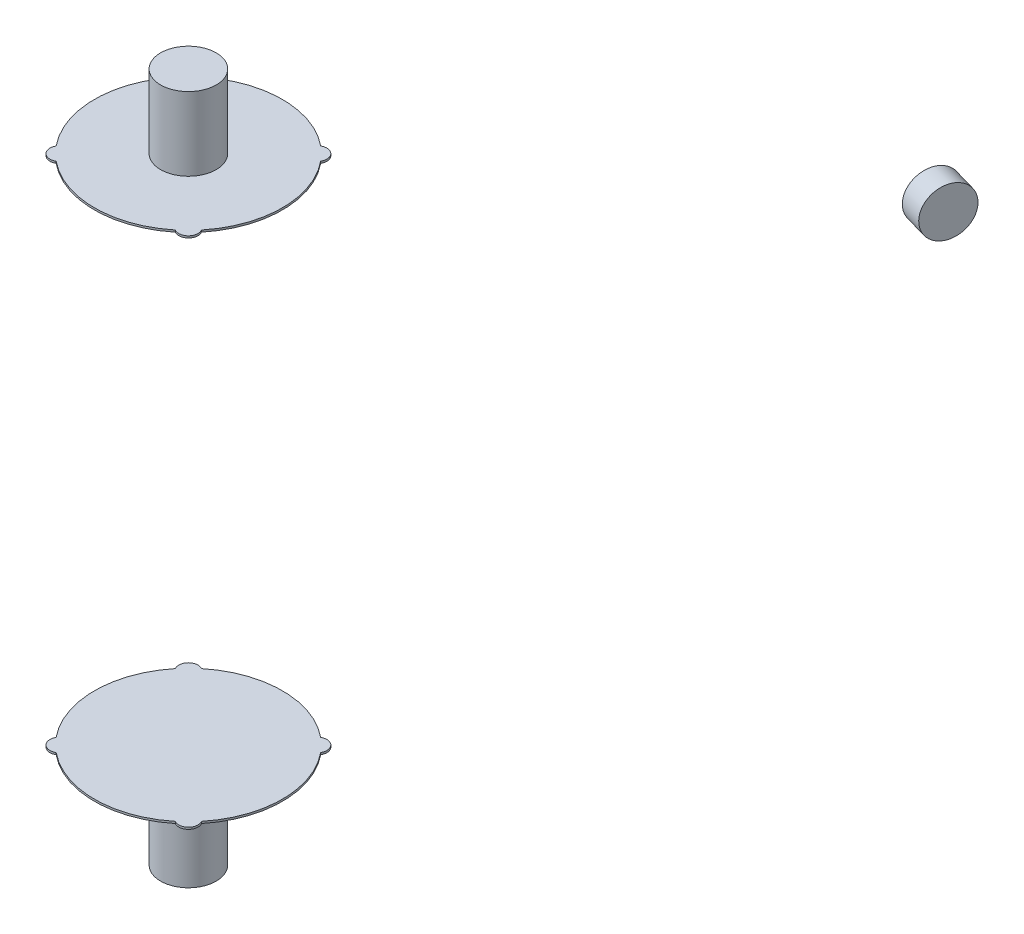
ISO-10303-21;
HEADER;
FILE_DESCRIPTION(('STEP AP214'),'2;1');
FILE_NAME('part.step','',(''),(''),'','','');
FILE_SCHEMA(('AUTOMOTIVE_DESIGN { 1 0 10303 214 1 1 1 1 }'));
ENDSEC;
DATA;
#1=APPLICATION_CONTEXT('core data for automotive mechanical design processes');
#2=APPLICATION_PROTOCOL_DEFINITION('international standard','automotive_design',2000,#1);
#3=PRODUCT_CONTEXT('',#1,'mechanical');
#4=PRODUCT('Part','Part','',(#3));
#5=PRODUCT_RELATED_PRODUCT_CATEGORY('part','',(#4));
#6=PRODUCT_DEFINITION_FORMATION('','',#4);
#7=PRODUCT_DEFINITION_CONTEXT('part definition',#1,'design');
#8=PRODUCT_DEFINITION('design','',#6,#7);
#9=PRODUCT_DEFINITION_SHAPE('','',#8);
#10=(LENGTH_UNIT() NAMED_UNIT(*) SI_UNIT(.MILLI.,.METRE.));
#11=(NAMED_UNIT(*) PLANE_ANGLE_UNIT() SI_UNIT($,.RADIAN.));
#12=(NAMED_UNIT(*) SI_UNIT($,.STERADIAN.) SOLID_ANGLE_UNIT());
#13=UNCERTAINTY_MEASURE_WITH_UNIT(LENGTH_MEASURE(1.E-05),#10,'distance_accuracy_value','');
#14=(GEOMETRIC_REPRESENTATION_CONTEXT(3) GLOBAL_UNCERTAINTY_ASSIGNED_CONTEXT((#13)) GLOBAL_UNIT_ASSIGNED_CONTEXT((#10,
#11,#12)) REPRESENTATION_CONTEXT('',''));
#15=CARTESIAN_POINT('',(0.,0.,0.));
#16=DIRECTION('',(0.,0.,1.));
#17=DIRECTION('',(1.,0.,0.));
#18=AXIS2_PLACEMENT_3D('',#15,#16,#17);
#19=CARTESIAN_POINT('',(0.,359.5,1120.));
#20=DIRECTION('',(0.,-1.,0.));
#21=DIRECTION('',(0.,0.,-1.));
#22=AXIS2_PLACEMENT_3D('',#19,#20,#21);
#23=PLANE('',#22);
#24=CARTESIAN_POINT('',(0.,359.5,1120.));
#25=DIRECTION('',(0.,-1.,0.));
#26=DIRECTION('',(-1.,0.,0.));
#27=AXIS2_PLACEMENT_3D('',#24,#25,#26);
#28=CIRCLE('',#27,29.);
#29=CARTESIAN_POINT('',(-29.,359.5,1120.));
#30=VERTEX_POINT('',#29);
#31=EDGE_CURVE('E243',#30,#30,#28,.T.);
#32=ORIENTED_EDGE('',*,*,#31,.F.);
#33=EDGE_LOOP('',(#32));
#34=FACE_BOUND('',#33,.T.);
#35=ADVANCED_FACE('F322',(#34),#23,.F.);
#36=CARTESIAN_POINT('',(0.,359.5,1120.));
#37=DIRECTION('',(0.,-1.,0.));
#38=DIRECTION('',(0.,0.,-1.));
#39=AXIS2_PLACEMENT_3D('',#36,#37,#38);
#40=CYLINDRICAL_SURFACE('',#39,29.);
#41=ORIENTED_EDGE('',*,*,#31,.T.);
#42=EDGE_LOOP('',(#41));
#43=FACE_BOUND('',#42,.T.);
#44=CARTESIAN_POINT('',(0.,283.,1120.));
#45=DIRECTION('',(0.,-1.,0.));
#46=DIRECTION('',(-1.,0.,0.));
#47=AXIS2_PLACEMENT_3D('',#44,#45,#46);
#48=CIRCLE('',#47,29.);
#49=CARTESIAN_POINT('',(-29.,283.,1120.));
#50=VERTEX_POINT('',#49);
#51=EDGE_CURVE('E238',#50,#50,#48,.T.);
#52=ORIENTED_EDGE('',*,*,#51,.F.);
#53=EDGE_LOOP('',(#52));
#54=FACE_BOUND('',#53,.T.);
#55=ADVANCED_FACE('F324',(#43,#54),#40,.T.);
#56=CARTESIAN_POINT('',(33.587572106361,283.,1086.41242789364));
#57=DIRECTION('',(0.,-1.,0.));
#58=DIRECTION('',(0.,0.,-1.));
#59=AXIS2_PLACEMENT_3D('',#56,#57,#58);
#60=PLANE('',#59);
#61=ORIENTED_EDGE('',*,*,#51,.T.);
#62=EDGE_LOOP('',(#61));
#63=FACE_BOUND('',#62,.T.);
#64=CARTESIAN_POINT('',(0.,283.,1120.));
#65=DIRECTION('',(0.,-1.,0.));
#66=DIRECTION('',(-1.,0.,0.));
#67=AXIS2_PLACEMENT_3D('',#64,#65,#66);
#68=CIRCLE('',#67,98.);
#69=CARTESIAN_POINT('',(-62.1151265949994,283.,1044.19953134652));
#70=VERTEX_POINT('',#69);
#71=CARTESIAN_POINT('',(62.1151265949994,283.,1044.19953134652));
#72=VERTEX_POINT('',#71);
#73=EDGE_CURVE('E157',#70,#72,#68,.T.);
#74=ORIENTED_EDGE('',*,*,#73,.F.);
#75=CARTESIAN_POINT('',(-67.175144212722,283.,1052.82485578728));
#76=DIRECTION('',(0.,-1.,0.));
#77=DIRECTION('',(1.,0.,0.));
#78=AXIS2_PLACEMENT_3D('',#75,#76,#77);
#79=CIRCLE('',#78,10.);
#80=CARTESIAN_POINT('',(-75.80046865348,283.,1057.884873405));
#81=VERTEX_POINT('',#80);
#82=EDGE_CURVE('E149',#81,#70,#79,.T.);
#83=ORIENTED_EDGE('',*,*,#82,.F.);
#84=CARTESIAN_POINT('',(0.,283.,1120.));
#85=DIRECTION('',(0.,-1.,0.));
#86=DIRECTION('',(1.,0.,0.));
#87=AXIS2_PLACEMENT_3D('',#84,#85,#86);
#88=CIRCLE('',#87,98.);
#89=CARTESIAN_POINT('',(-75.8004686534801,283.,1182.115126595));
#90=VERTEX_POINT('',#89);
#91=EDGE_CURVE('E154',#90,#81,#88,.T.);
#92=ORIENTED_EDGE('',*,*,#91,.F.);
#93=CARTESIAN_POINT('',(-67.175144212722,283.,1187.17514421272));
#94=DIRECTION('',(0.,-1.,0.));
#95=DIRECTION('',(1.,0.,0.));
#96=AXIS2_PLACEMENT_3D('',#93,#94,#95);
#97=CIRCLE('',#96,10.);
#98=CARTESIAN_POINT('',(-62.1151265949995,283.,1195.80046865348));
#99=VERTEX_POINT('',#98);
#100=EDGE_CURVE('E218',#99,#90,#97,.T.);
#101=ORIENTED_EDGE('',*,*,#100,.F.);
#102=CARTESIAN_POINT('',(0.,283.,1120.));
#103=DIRECTION('',(0.,-1.,0.));
#104=DIRECTION('',(-1.,0.,0.));
#105=AXIS2_PLACEMENT_3D('',#102,#103,#104);
#106=CIRCLE('',#105,98.);
#107=CARTESIAN_POINT('',(62.1151265949994,283.,1195.80046865348));
#108=VERTEX_POINT('',#107);
#109=EDGE_CURVE('E216',#108,#99,#106,.T.);
#110=ORIENTED_EDGE('',*,*,#109,.F.);
#111=CARTESIAN_POINT('',(67.175144212722,283.,1187.17514421272));
#112=DIRECTION('',(0.,-1.,0.));
#113=DIRECTION('',(-1.,0.,0.));
#114=AXIS2_PLACEMENT_3D('',#111,#112,#113);
#115=CIRCLE('',#114,10.);
#116=CARTESIAN_POINT('',(75.80046865348,283.,1182.115126595));
#117=VERTEX_POINT('',#116);
#118=EDGE_CURVE('E208',#117,#108,#115,.T.);
#119=ORIENTED_EDGE('',*,*,#118,.F.);
#120=CARTESIAN_POINT('',(0.,283.,1120.));
#121=DIRECTION('',(0.,-1.,0.));
#122=DIRECTION('',(-1.,0.,0.));
#123=AXIS2_PLACEMENT_3D('',#120,#121,#122);
#124=CIRCLE('',#123,98.);
#125=CARTESIAN_POINT('',(75.8004686534801,283.,1057.884873405));
#126=VERTEX_POINT('',#125);
#127=EDGE_CURVE('E203',#126,#117,#124,.T.);
#128=ORIENTED_EDGE('',*,*,#127,.F.);
#129=CARTESIAN_POINT('',(67.175144212722,283.,1052.82485578728));
#130=DIRECTION('',(0.,-1.,0.));
#131=DIRECTION('',(-1.,0.,0.));
#132=AXIS2_PLACEMENT_3D('',#129,#130,#131);
#133=CIRCLE('',#132,10.);
#134=EDGE_CURVE('E209',#72,#126,#133,.T.);
#135=ORIENTED_EDGE('',*,*,#134,.F.);
#136=EDGE_LOOP('',(#74,#83,#92,#101,#110,#119,#128,#135));
#137=FACE_BOUND('',#136,.T.);
#138=ADVANCED_FACE('F213',(#63,#137),#60,.F.);
#139=CARTESIAN_POINT('',(-67.175144212722,258.,1187.17514421272));
#140=DIRECTION('',(0.,1.,0.));
#141=DIRECTION('',(0.,0.,1.));
#142=AXIS2_PLACEMENT_3D('',#139,#140,#141);
#143=CYLINDRICAL_SURFACE('',#142,10.);
#144=DIRECTION('',(0.,1.,0.));
#145=VECTOR('',#144,1.);
#146=CARTESIAN_POINT('',(-75.80046865348,269.5,1182.115126595));
#147=LINE('',#146,#145);
#148=CARTESIAN_POINT('',(-75.80046865348,281.,1182.115126595));
#149=VERTEX_POINT('',#148);
#150=EDGE_CURVE('E186',#149,#90,#147,.T.);
#151=ORIENTED_EDGE('',*,*,#150,.F.);
#152=CARTESIAN_POINT('',(-67.175144212722,281.,1187.17514421272));
#153=DIRECTION('',(0.,1.,0.));
#154=DIRECTION('',(0.,0.,1.));
#155=AXIS2_PLACEMENT_3D('',#152,#153,#154);
#156=CIRCLE('',#155,10.);
#157=CARTESIAN_POINT('',(-62.1151265949995,281.,1195.80046865348));
#158=VERTEX_POINT('',#157);
#159=EDGE_CURVE('E284',#149,#158,#156,.T.);
#160=ORIENTED_EDGE('',*,*,#159,.T.);
#161=DIRECTION('',(0.,1.,0.));
#162=VECTOR('',#161,1.);
#163=CARTESIAN_POINT('',(-62.1151265949994,269.5,1195.80046865348));
#164=LINE('',#163,#162);
#165=EDGE_CURVE('E188',#99,#158,#164,.F.);
#166=ORIENTED_EDGE('',*,*,#165,.F.);
#167=ORIENTED_EDGE('',*,*,#100,.T.);
#168=EDGE_LOOP('',(#151,#160,#166,#167));
#169=FACE_BOUND('',#168,.T.);
#170=ADVANCED_FACE('F352',(#169),#143,.T.);
#171=CARTESIAN_POINT('',(67.175144212722,258.,1187.17514421272));
#172=DIRECTION('',(0.,1.,0.));
#173=DIRECTION('',(0.,0.,1.));
#174=AXIS2_PLACEMENT_3D('',#171,#172,#173);
#175=CYLINDRICAL_SURFACE('',#174,10.);
#176=DIRECTION('',(0.,1.,0.));
#177=VECTOR('',#176,1.);
#178=CARTESIAN_POINT('',(62.1151265949995,269.5,1195.80046865348));
#179=LINE('',#178,#177);
#180=CARTESIAN_POINT('',(62.1151265949994,281.,1195.80046865348));
#181=VERTEX_POINT('',#180);
#182=EDGE_CURVE('E171',#181,#108,#179,.T.);
#183=ORIENTED_EDGE('',*,*,#182,.F.);
#184=CARTESIAN_POINT('',(67.175144212722,281.,1187.17514421272));
#185=DIRECTION('',(0.,1.,0.));
#186=DIRECTION('',(0.,0.,1.));
#187=AXIS2_PLACEMENT_3D('',#184,#185,#186);
#188=CIRCLE('',#187,10.);
#189=CARTESIAN_POINT('',(75.80046865348,281.,1182.115126595));
#190=VERTEX_POINT('',#189);
#191=EDGE_CURVE('E26',#181,#190,#188,.T.);
#192=ORIENTED_EDGE('',*,*,#191,.T.);
#193=DIRECTION('',(0.,1.,0.));
#194=VECTOR('',#193,1.);
#195=CARTESIAN_POINT('',(75.80046865348,269.5,1182.115126595));
#196=LINE('',#195,#194);
#197=EDGE_CURVE('E173',#117,#190,#196,.F.);
#198=ORIENTED_EDGE('',*,*,#197,.F.);
#199=ORIENTED_EDGE('',*,*,#118,.T.);
#200=EDGE_LOOP('',(#183,#192,#198,#199));
#201=FACE_BOUND('',#200,.T.);
#202=ADVANCED_FACE('F195',(#201),#175,.T.);
#203=CARTESIAN_POINT('',(0.,-200.,1120.));
#204=DIRECTION('',(0.,1.,0.));
#205=DIRECTION('',(0.,0.,1.));
#206=AXIS2_PLACEMENT_3D('',#203,#204,#205);
#207=CYLINDRICAL_SURFACE('',#206,98.);
#208=CARTESIAN_POINT('',(0.,281.,1120.));
#209=DIRECTION('',(0.,1.,0.));
#210=DIRECTION('',(0.,0.,1.));
#211=AXIS2_PLACEMENT_3D('',#208,#209,#210);
#212=CIRCLE('',#211,98.);
#213=EDGE_CURVE('E247',#181,#158,#212,.F.);
#214=ORIENTED_EDGE('',*,*,#213,.F.);
#215=ORIENTED_EDGE('',*,*,#182,.T.);
#216=ORIENTED_EDGE('',*,*,#109,.T.);
#217=ORIENTED_EDGE('',*,*,#165,.T.);
#218=EDGE_LOOP('',(#214,#215,#216,#217));
#219=FACE_BOUND('',#218,.T.);
#220=ADVANCED_FACE('F371',(#219),#207,.T.);
#221=CARTESIAN_POINT('',(67.175144212722,258.,1052.82485578728));
#222=DIRECTION('',(0.,1.,0.));
#223=DIRECTION('',(0.,0.,1.));
#224=AXIS2_PLACEMENT_3D('',#221,#222,#223);
#225=CYLINDRICAL_SURFACE('',#224,10.);
#226=DIRECTION('',(0.,1.,0.));
#227=VECTOR('',#226,1.);
#228=CARTESIAN_POINT('',(75.80046865348,269.5,1057.884873405));
#229=LINE('',#228,#227);
#230=CARTESIAN_POINT('',(75.80046865348,281.,1057.884873405));
#231=VERTEX_POINT('',#230);
#232=EDGE_CURVE('E176',#231,#126,#229,.T.);
#233=ORIENTED_EDGE('',*,*,#232,.F.);
#234=CARTESIAN_POINT('',(67.175144212722,281.,1052.82485578728));
#235=DIRECTION('',(0.,1.,0.));
#236=DIRECTION('',(0.,0.,1.));
#237=AXIS2_PLACEMENT_3D('',#234,#235,#236);
#238=CIRCLE('',#237,10.);
#239=CARTESIAN_POINT('',(62.1151265949995,281.,1044.19953134652));
#240=VERTEX_POINT('',#239);
#241=EDGE_CURVE('E286',#231,#240,#238,.T.);
#242=ORIENTED_EDGE('',*,*,#241,.T.);
#243=DIRECTION('',(0.,1.,0.));
#244=VECTOR('',#243,1.);
#245=CARTESIAN_POINT('',(62.1151265949995,269.5,1044.19953134652));
#246=LINE('',#245,#244);
#247=EDGE_CURVE('E178',#72,#240,#246,.F.);
#248=ORIENTED_EDGE('',*,*,#247,.F.);
#249=ORIENTED_EDGE('',*,*,#134,.T.);
#250=EDGE_LOOP('',(#233,#242,#248,#249));
#251=FACE_BOUND('',#250,.T.);
#252=ADVANCED_FACE('F372',(#251),#225,.T.);
#253=CARTESIAN_POINT('',(-67.175144212722,258.,1052.82485578728));
#254=DIRECTION('',(0.,1.,0.));
#255=DIRECTION('',(0.,0.,1.));
#256=AXIS2_PLACEMENT_3D('',#253,#254,#255);
#257=CYLINDRICAL_SURFACE('',#256,10.);
#258=DIRECTION('',(0.,1.,0.));
#259=VECTOR('',#258,1.);
#260=CARTESIAN_POINT('',(-62.1151265949994,269.5,1044.19953134652));
#261=LINE('',#260,#259);
#262=CARTESIAN_POINT('',(-62.1151265949994,281.,1044.19953134652));
#263=VERTEX_POINT('',#262);
#264=EDGE_CURVE('E181',#263,#70,#261,.T.);
#265=ORIENTED_EDGE('',*,*,#264,.F.);
#266=CARTESIAN_POINT('',(-67.175144212722,281.,1052.82485578728));
#267=DIRECTION('',(0.,1.,0.));
#268=DIRECTION('',(0.,0.,1.));
#269=AXIS2_PLACEMENT_3D('',#266,#267,#268);
#270=CIRCLE('',#269,10.);
#271=CARTESIAN_POINT('',(-75.80046865348,281.,1057.884873405));
#272=VERTEX_POINT('',#271);
#273=EDGE_CURVE('E236',#263,#272,#270,.T.);
#274=ORIENTED_EDGE('',*,*,#273,.T.);
#275=DIRECTION('',(0.,1.,0.));
#276=VECTOR('',#275,1.);
#277=CARTESIAN_POINT('',(-75.80046865348,269.5,1057.884873405));
#278=LINE('',#277,#276);
#279=EDGE_CURVE('E183',#81,#272,#278,.F.);
#280=ORIENTED_EDGE('',*,*,#279,.F.);
#281=ORIENTED_EDGE('',*,*,#82,.T.);
#282=EDGE_LOOP('',(#265,#274,#280,#281));
#283=FACE_BOUND('',#282,.T.);
#284=ADVANCED_FACE('F234',(#283),#257,.T.);
#285=CARTESIAN_POINT('',(0.,281.,1120.));
#286=DIRECTION('',(0.,1.,0.));
#287=DIRECTION('',(0.,0.,1.));
#288=AXIS2_PLACEMENT_3D('',#285,#286,#287);
#289=CIRCLE('',#288,98.);
#290=EDGE_CURVE('E245',#263,#240,#289,.F.);
#291=ORIENTED_EDGE('',*,*,#290,.F.);
#292=ORIENTED_EDGE('',*,*,#264,.T.);
#293=ORIENTED_EDGE('',*,*,#73,.T.);
#294=ORIENTED_EDGE('',*,*,#247,.T.);
#295=EDGE_LOOP('',(#291,#292,#293,#294));
#296=FACE_BOUND('',#295,.T.);
#297=ADVANCED_FACE('F282',(#296),#207,.T.);
#298=EDGE_CURVE('E40',#231,#190,#212,.F.);
#299=ORIENTED_EDGE('',*,*,#298,.F.);
#300=ORIENTED_EDGE('',*,*,#232,.T.);
#301=ORIENTED_EDGE('',*,*,#127,.T.);
#302=ORIENTED_EDGE('',*,*,#197,.T.);
#303=EDGE_LOOP('',(#299,#300,#301,#302));
#304=FACE_BOUND('',#303,.T.);
#305=ADVANCED_FACE('F200',(#304),#207,.T.);
#306=EDGE_CURVE('E239',#149,#272,#212,.F.);
#307=ORIENTED_EDGE('',*,*,#306,.F.);
#308=ORIENTED_EDGE('',*,*,#150,.T.);
#309=ORIENTED_EDGE('',*,*,#91,.T.);
#310=ORIENTED_EDGE('',*,*,#279,.T.);
#311=EDGE_LOOP('',(#307,#308,#309,#310));
#312=FACE_BOUND('',#311,.T.);
#313=ADVANCED_FACE('F229',(#312),#207,.T.);
#314=CARTESIAN_POINT('',(0.,281.,1120.));
#315=DIRECTION('',(0.,1.,0.));
#316=DIRECTION('',(0.,0.,1.));
#317=AXIS2_PLACEMENT_3D('',#314,#315,#316);
#318=PLANE('',#317);
#319=ORIENTED_EDGE('',*,*,#290,.T.);
#320=ORIENTED_EDGE('',*,*,#241,.F.);
#321=ORIENTED_EDGE('',*,*,#298,.T.);
#322=ORIENTED_EDGE('',*,*,#191,.F.);
#323=ORIENTED_EDGE('',*,*,#213,.T.);
#324=ORIENTED_EDGE('',*,*,#159,.F.);
#325=ORIENTED_EDGE('',*,*,#306,.T.);
#326=ORIENTED_EDGE('',*,*,#273,.F.);
#327=EDGE_LOOP('',(#319,#320,#321,#322,#323,#324,#325,#326));
#328=FACE_BOUND('',#327,.T.);
#329=ADVANCED_FACE('F335',(#328),#318,.F.);
#330=CLOSED_SHELL('',(#35,#55,#138,#170,#202,#220,#252,#284,#297,#305,#313,#329));
#331=MANIFOLD_SOLID_BREP('B1',#330);
#332=CARTESIAN_POINT('',(133.73015851266,-32.0000000001681,461.345883863032));
#333=DIRECTION('',(-0.96126169593832,0.,-0.275637355816995));
#334=DIRECTION('',(0.275637355816995,0.,-0.96126169593832));
#335=AXIS2_PLACEMENT_3D('',#332,#333,#334);
#336=CYLINDRICAL_SURFACE('',#335,25.);
#337=CARTESIAN_POINT('',(133.73015851266,-32.0000000001681,461.345883863032));
#338=DIRECTION('',(0.96126169593832,0.,0.275637355816995));
#339=DIRECTION('',(0.,-1.,0.));
#340=AXIS2_PLACEMENT_3D('',#337,#338,#339);
#341=CIRCLE('',#340,25.);
#342=CARTESIAN_POINT('',(133.73015851266,-57.0000000001681,461.345883863032));
#343=VERTEX_POINT('',#342);
#344=EDGE_CURVE('E191',#343,#343,#341,.T.);
#345=ORIENTED_EDGE('',*,*,#344,.F.);
#346=EDGE_LOOP('',(#345));
#347=FACE_BOUND('',#346,.T.);
#348=CARTESIAN_POINT('',(109.698616114202,-32.0000000001681,454.454949967608));
#349=DIRECTION('',(-0.96126169593832,0.,-0.275637355816995));
#350=DIRECTION('',(-0.275637355816995,0.,0.96126169593832));
#351=AXIS2_PLACEMENT_3D('',#348,#349,#350);
#352=CIRCLE('',#351,25.);
#353=CARTESIAN_POINT('',(102.807682218777,-32.0000000001681,478.486492366066));
#354=VERTEX_POINT('',#353);
#355=EDGE_CURVE('E141',#354,#354,#352,.T.);
#356=ORIENTED_EDGE('',*,*,#355,.F.);
#357=EDGE_LOOP('',(#356));
#358=FACE_BOUND('',#357,.T.);
#359=ADVANCED_FACE('F19',(#347,#358),#336,.T.);
#360=CARTESIAN_POINT('',(133.73015851266,-32.0000000001681,461.345883863032));
#361=DIRECTION('',(0.96126169593832,0.,0.275637355816995));
#362=DIRECTION('',(-0.275637355816995,0.,0.96126169593832));
#363=AXIS2_PLACEMENT_3D('',#360,#361,#362);
#364=PLANE('',#363);
#365=ORIENTED_EDGE('',*,*,#344,.T.);
#366=EDGE_LOOP('',(#365));
#367=FACE_BOUND('',#366,.T.);
#368=ADVANCED_FACE('F309',(#367),#364,.T.);
#369=CARTESIAN_POINT('',(109.698616114202,-32.0000000001681,454.454949967608));
#370=DIRECTION('',(-0.96126169593832,0.,-0.275637355816995));
#371=DIRECTION('',(-0.275637355816995,0.,0.96126169593832));
#372=AXIS2_PLACEMENT_3D('',#369,#370,#371);
#373=PLANE('',#372);
#374=ORIENTED_EDGE('',*,*,#355,.T.);
#375=EDGE_LOOP('',(#374));
#376=FACE_BOUND('',#375,.T.);
#377=ADVANCED_FACE('F306',(#376),#373,.T.);
#378=CLOSED_SHELL('',(#359,#368,#377));
#379=MANIFOLD_SOLID_BREP('B1',#378);
#380=CARTESIAN_POINT('',(0.,-359.5,1120.));
#381=DIRECTION('',(0.,1.,0.));
#382=DIRECTION('',(0.,0.,1.));
#383=AXIS2_PLACEMENT_3D('',#380,#381,#382);
#384=PLANE('',#383);
#385=CARTESIAN_POINT('',(0.,-359.5,1120.));
#386=DIRECTION('',(0.,1.,0.));
#387=DIRECTION('',(1.,0.,0.));
#388=AXIS2_PLACEMENT_3D('',#385,#386,#387);
#389=CIRCLE('',#388,29.);
#390=CARTESIAN_POINT('',(29.,-359.5,1120.));
#391=VERTEX_POINT('',#390);
#392=EDGE_CURVE('E254',#391,#391,#389,.T.);
#393=ORIENTED_EDGE('',*,*,#392,.F.);
#394=EDGE_LOOP('',(#393));
#395=FACE_BOUND('',#394,.T.);
#396=ADVANCED_FACE('F17',(#395),#384,.F.);
#397=CARTESIAN_POINT('',(0.,-359.5,1120.));
#398=DIRECTION('',(0.,1.,0.));
#399=DIRECTION('',(0.,0.,1.));
#400=AXIS2_PLACEMENT_3D('',#397,#398,#399);
#401=CYLINDRICAL_SURFACE('',#400,29.);
#402=ORIENTED_EDGE('',*,*,#392,.T.);
#403=EDGE_LOOP('',(#402));
#404=FACE_BOUND('',#403,.T.);
#405=CARTESIAN_POINT('',(0.,-253.,1120.));
#406=DIRECTION('',(0.,1.,0.));
#407=DIRECTION('',(1.,0.,0.));
#408=AXIS2_PLACEMENT_3D('',#405,#406,#407);
#409=CIRCLE('',#408,29.);
#410=CARTESIAN_POINT('',(29.,-253.,1120.));
#411=VERTEX_POINT('',#410);
#412=EDGE_CURVE('E252',#411,#411,#409,.T.);
#413=ORIENTED_EDGE('',*,*,#412,.F.);
#414=EDGE_LOOP('',(#413));
#415=FACE_BOUND('',#414,.T.);
#416=ADVANCED_FACE('F340',(#404,#415),#401,.T.);
#417=CARTESIAN_POINT('',(-33.587572106361,-253.,1086.41242789364));
#418=DIRECTION('',(0.,1.,0.));
#419=DIRECTION('',(0.,0.,1.));
#420=AXIS2_PLACEMENT_3D('',#417,#418,#419);
#421=PLANE('',#420);
#422=ORIENTED_EDGE('',*,*,#412,.T.);
#423=EDGE_LOOP('',(#422));
#424=FACE_BOUND('',#423,.T.);
#425=CARTESIAN_POINT('',(0.,-253.,1120.));
#426=DIRECTION('',(0.,1.,0.));
#427=DIRECTION('',(1.,0.,0.));
#428=AXIS2_PLACEMENT_3D('',#425,#426,#427);
#429=CIRCLE('',#428,98.);
#430=CARTESIAN_POINT('',(62.1151265949994,-253.,1044.19953134652));
#431=VERTEX_POINT('',#430);
#432=CARTESIAN_POINT('',(-62.1151265949994,-253.,1044.19953134652));
#433=VERTEX_POINT('',#432);
#434=EDGE_CURVE('E257',#431,#433,#429,.T.);
#435=ORIENTED_EDGE('',*,*,#434,.F.);
#436=CARTESIAN_POINT('',(67.175144212722,-253.,1052.82485578728));
#437=DIRECTION('',(0.,1.,0.));
#438=DIRECTION('',(-1.,0.,0.));
#439=AXIS2_PLACEMENT_3D('',#436,#437,#438);
#440=CIRCLE('',#439,10.);
#441=CARTESIAN_POINT('',(75.80046865348,-253.,1057.884873405));
#442=VERTEX_POINT('',#441);
#443=EDGE_CURVE('E276',#442,#431,#440,.T.);
#444=ORIENTED_EDGE('',*,*,#443,.F.);
#445=CARTESIAN_POINT('',(0.,-253.,1120.));
#446=DIRECTION('',(0.,1.,0.));
#447=DIRECTION('',(-1.,0.,0.));
#448=AXIS2_PLACEMENT_3D('',#445,#446,#447);
#449=CIRCLE('',#448,98.);
#450=CARTESIAN_POINT('',(75.8004686562708,-253.,1182.11512659159));
#451=VERTEX_POINT('',#450);
#452=EDGE_CURVE('E273',#451,#442,#449,.T.);
#453=ORIENTED_EDGE('',*,*,#452,.F.);
#454=CARTESIAN_POINT('',(67.1751442127221,-253.,1187.17514421272));
#455=DIRECTION('',(0.,1.,0.));
#456=DIRECTION('',(-1.,0.,0.));
#457=AXIS2_PLACEMENT_3D('',#454,#455,#456);
#458=CIRCLE('',#457,10.0000000041303);
#459=CARTESIAN_POINT('',(62.1151265915939,-253.,1195.80046865627));
#460=VERTEX_POINT('',#459);
#461=EDGE_CURVE('E270',#460,#451,#458,.T.);
#462=ORIENTED_EDGE('',*,*,#461,.F.);
#463=CARTESIAN_POINT('',(0.,-253.,1120.));
#464=DIRECTION('',(0.,1.,0.));
#465=DIRECTION('',(1.,0.,0.));
#466=AXIS2_PLACEMENT_3D('',#463,#464,#465);
#467=CIRCLE('',#466,98.);
#468=CARTESIAN_POINT('',(-62.1151265915949,-253.,1195.80046865627));
#469=VERTEX_POINT('',#468);
#470=EDGE_CURVE('E268',#469,#460,#467,.T.);
#471=ORIENTED_EDGE('',*,*,#470,.F.);
#472=CARTESIAN_POINT('',(-67.175144212722,-253.,1187.17514421272));
#473=DIRECTION('',(0.,1.,0.));
#474=DIRECTION('',(1.,0.,0.));
#475=AXIS2_PLACEMENT_3D('',#472,#473,#474);
#476=CIRCLE('',#475,10.0000000041291);
#477=CARTESIAN_POINT('',(-75.8004686562699,-253.,1182.11512659159));
#478=VERTEX_POINT('',#477);
#479=EDGE_CURVE('E146',#478,#469,#476,.T.);
#480=ORIENTED_EDGE('',*,*,#479,.F.);
#481=CARTESIAN_POINT('',(0.,-253.,1120.));
#482=DIRECTION('',(0.,1.,0.));
#483=DIRECTION('',(1.,0.,0.));
#484=AXIS2_PLACEMENT_3D('',#481,#482,#483);
#485=CIRCLE('',#484,98.);
#486=CARTESIAN_POINT('',(-75.8004686534801,-253.,1057.884873405));
#487=VERTEX_POINT('',#486);
#488=EDGE_CURVE('E264',#487,#478,#485,.T.);
#489=ORIENTED_EDGE('',*,*,#488,.F.);
#490=CARTESIAN_POINT('',(-67.175144212722,-253.,1052.82485578728));
#491=DIRECTION('',(0.,1.,0.));
#492=DIRECTION('',(1.,0.,0.));
#493=AXIS2_PLACEMENT_3D('',#490,#491,#492);
#494=CIRCLE('',#493,10.);
#495=EDGE_CURVE('E261',#433,#487,#494,.T.);
#496=ORIENTED_EDGE('',*,*,#495,.F.);
#497=EDGE_LOOP('',(#435,#444,#453,#462,#471,#480,#489,#496));
#498=FACE_BOUND('',#497,.T.);
#499=ADVANCED_FACE('F344',(#424,#498),#421,.F.);
#500=CARTESIAN_POINT('',(-67.175144212722,1438.25060334071,1052.82485578728));
#501=DIRECTION('',(0.,-1.,0.));
#502=DIRECTION('',(0.,0.,-1.));
#503=AXIS2_PLACEMENT_3D('',#500,#501,#502);
#504=CYLINDRICAL_SURFACE('',#503,10.);
#505=DIRECTION('',(0.,-1.,0.));
#506=VECTOR('',#505,1.);
#507=CARTESIAN_POINT('',(-75.80046865348,593.625301670356,1057.884873405));
#508=LINE('',#507,#506);
#509=CARTESIAN_POINT('',(-75.80046865348,-251.,1057.884873405));
#510=VERTEX_POINT('',#509);
#511=EDGE_CURVE('E169',#510,#487,#508,.T.);
#512=ORIENTED_EDGE('',*,*,#511,.F.);
#513=CARTESIAN_POINT('',(-67.175144212722,-251.,1052.82485578728));
#514=DIRECTION('',(0.,-1.,0.));
#515=DIRECTION('',(0.,0.,-1.));
#516=AXIS2_PLACEMENT_3D('',#513,#514,#515);
#517=CIRCLE('',#516,10.);
#518=CARTESIAN_POINT('',(-62.1151265949994,-251.,1044.19953134652));
#519=VERTEX_POINT('',#518);
#520=EDGE_CURVE('E295',#510,#519,#517,.T.);
#521=ORIENTED_EDGE('',*,*,#520,.T.);
#522=DIRECTION('',(0.,-1.,0.));
#523=VECTOR('',#522,1.);
#524=CARTESIAN_POINT('',(-62.1151265949994,593.625301670356,1044.19953134652));
#525=LINE('',#524,#523);
#526=EDGE_CURVE('E166',#433,#519,#525,.F.);
#527=ORIENTED_EDGE('',*,*,#526,.F.);
#528=ORIENTED_EDGE('',*,*,#495,.T.);
#529=EDGE_LOOP('',(#512,#521,#527,#528));
#530=FACE_BOUND('',#529,.T.);
#531=ADVANCED_FACE('F348',(#530),#504,.T.);
#532=CARTESIAN_POINT('',(67.175144212722,1438.25060334071,1052.82485578728));
#533=DIRECTION('',(0.,-1.,0.));
#534=DIRECTION('',(0.,0.,-1.));
#535=AXIS2_PLACEMENT_3D('',#532,#533,#534);
#536=CYLINDRICAL_SURFACE('',#535,10.);
#537=DIRECTION('',(0.,-1.,0.));
#538=VECTOR('',#537,1.);
#539=CARTESIAN_POINT('',(62.1151265949995,593.625301670356,1044.19953134652));
#540=LINE('',#539,#538);
#541=CARTESIAN_POINT('',(62.1151265949995,-251.,1044.19953134652));
#542=VERTEX_POINT('',#541);
#543=EDGE_CURVE('E164',#542,#431,#540,.T.);
#544=ORIENTED_EDGE('',*,*,#543,.F.);
#545=CARTESIAN_POINT('',(67.175144212722,-251.,1052.82485578728));
#546=DIRECTION('',(0.,-1.,0.));
#547=DIRECTION('',(0.,0.,-1.));
#548=AXIS2_PLACEMENT_3D('',#545,#546,#547);
#549=CIRCLE('',#548,10.);
#550=CARTESIAN_POINT('',(75.8004686534801,-251.,1057.884873405));
#551=VERTEX_POINT('',#550);
#552=EDGE_CURVE('E290',#542,#551,#549,.T.);
#553=ORIENTED_EDGE('',*,*,#552,.T.);
#554=DIRECTION('',(0.,-1.,0.));
#555=VECTOR('',#554,1.);
#556=CARTESIAN_POINT('',(75.80046865348,593.625301670356,1057.884873405));
#557=LINE('',#556,#555);
#558=EDGE_CURVE('E161',#442,#551,#557,.F.);
#559=ORIENTED_EDGE('',*,*,#558,.F.);
#560=ORIENTED_EDGE('',*,*,#443,.T.);
#561=EDGE_LOOP('',(#544,#553,#559,#560));
#562=FACE_BOUND('',#561,.T.);
#563=ADVANCED_FACE('F362',(#562),#536,.T.);
#564=CARTESIAN_POINT('',(0.,-251.,1120.));
#565=DIRECTION('',(0.,-1.,0.));
#566=DIRECTION('',(0.,0.,-1.));
#567=AXIS2_PLACEMENT_3D('',#564,#565,#566);
#568=CIRCLE('',#567,98.);
#569=EDGE_CURVE('E293',#542,#519,#568,.F.);
#570=ORIENTED_EDGE('',*,*,#569,.F.);
#571=ORIENTED_EDGE('',*,*,#543,.T.);
#572=ORIENTED_EDGE('',*,*,#434,.T.);
#573=ORIENTED_EDGE('',*,*,#526,.T.);
#574=EDGE_LOOP('',(#570,#571,#572,#573));
#575=FACE_BOUND('',#574,.T.);
#576=ADVANCED_FACE('F360',(#575),#207,.T.);
#577=CARTESIAN_POINT('',(67.1751442127221,-228.,1187.17514421272));
#578=DIRECTION('',(0.,-1.,0.));
#579=DIRECTION('',(0.,0.,-1.));
#580=AXIS2_PLACEMENT_3D('',#577,#578,#579);
#581=CYLINDRICAL_SURFACE('',#580,10.0000000041303);
#582=CARTESIAN_POINT('',(67.1751442127221,-251.,1187.17514421272));
#583=DIRECTION('',(0.,-1.,0.));
#584=DIRECTION('',(0.,0.,-1.));
#585=AXIS2_PLACEMENT_3D('',#582,#583,#584);
#586=CIRCLE('',#585,10.0000000041303);
#587=CARTESIAN_POINT('',(62.1151265915939,-251.,1195.80046865627));
#588=VERTEX_POINT('',#587);
#589=CARTESIAN_POINT('',(75.8004686562708,-251.,1182.11512659159));
#590=VERTEX_POINT('',#589);
#591=EDGE_CURVE('E298',#588,#590,#586,.F.);
#592=ORIENTED_EDGE('',*,*,#591,.F.);
#593=DIRECTION('',(0.,-1.,0.));
#594=VECTOR('',#593,1.);
#595=CARTESIAN_POINT('',(62.1151265916103,-228.,1195.80046865628));
#596=LINE('',#595,#594);
#597=EDGE_CURVE('E140',#588,#460,#596,.T.);
#598=ORIENTED_EDGE('',*,*,#597,.T.);
#599=ORIENTED_EDGE('',*,*,#461,.T.);
#600=DIRECTION('',(0.,-1.,0.));
#601=VECTOR('',#600,1.);
#602=CARTESIAN_POINT('',(75.8004686562787,-228.,1182.11512659161));
#603=LINE('',#602,#601);
#604=EDGE_CURVE('E151',#590,#451,#603,.T.);
#605=ORIENTED_EDGE('',*,*,#604,.F.);
#606=EDGE_LOOP('',(#592,#598,#599,#605));
#607=FACE_BOUND('',#606,.T.);
#608=ADVANCED_FACE('F357',(#607),#581,.T.);
#609=CARTESIAN_POINT('',(0.,-251.,1120.));
#610=DIRECTION('',(0.,-1.,0.));
#611=DIRECTION('',(0.,0.,-1.));
#612=AXIS2_PLACEMENT_3D('',#609,#610,#611);
#613=CIRCLE('',#612,98.);
#614=EDGE_CURVE('E143',#590,#551,#613,.F.);
#615=ORIENTED_EDGE('',*,*,#614,.F.);
#616=ORIENTED_EDGE('',*,*,#604,.T.);
#617=ORIENTED_EDGE('',*,*,#452,.T.);
#618=ORIENTED_EDGE('',*,*,#558,.T.);
#619=EDGE_LOOP('',(#615,#616,#617,#618));
#620=FACE_BOUND('',#619,.T.);
#621=ADVANCED_FACE('F356',(#620),#207,.T.);
#622=CARTESIAN_POINT('',(-67.175144212722,-228.,1187.17514421272));
#623=DIRECTION('',(0.,-1.,0.));
#624=DIRECTION('',(0.,0.,-1.));
#625=AXIS2_PLACEMENT_3D('',#622,#623,#624);
#626=CYLINDRICAL_SURFACE('',#625,10.0000000041291);
#627=DIRECTION('',(0.,-1.,0.));
#628=VECTOR('',#627,1.);
#629=CARTESIAN_POINT('',(-62.1151265916113,-228.,1195.80046865628));
#630=LINE('',#629,#628);
#631=CARTESIAN_POINT('',(-62.1151265915958,-251.,1195.80046865627));
#632=VERTEX_POINT('',#631);
#633=EDGE_CURVE('E138',#632,#469,#630,.T.);
#634=ORIENTED_EDGE('',*,*,#633,.F.);
#635=CARTESIAN_POINT('',(-67.175144212722,-251.,1187.17514421272));
#636=DIRECTION('',(0.,-1.,0.));
#637=DIRECTION('',(0.,0.,-1.));
#638=AXIS2_PLACEMENT_3D('',#635,#636,#637);
#639=CIRCLE('',#638,10.0000000041291);
#640=CARTESIAN_POINT('',(-75.8004686562778,-251.,1182.11512659161));
#641=VERTEX_POINT('',#640);
#642=EDGE_CURVE('E11',#632,#641,#639,.T.);
#643=ORIENTED_EDGE('',*,*,#642,.T.);
#644=DIRECTION('',(0.,-1.,0.));
#645=VECTOR('',#644,1.);
#646=CARTESIAN_POINT('',(-75.8004686562778,-228.,1182.11512659161));
#647=LINE('',#646,#645);
#648=EDGE_CURVE('E148',#641,#478,#647,.T.);
#649=ORIENTED_EDGE('',*,*,#648,.T.);
#650=ORIENTED_EDGE('',*,*,#479,.T.);
#651=EDGE_LOOP('',(#634,#643,#649,#650));
#652=FACE_BOUND('',#651,.T.);
#653=ADVANCED_FACE('F144',(#652),#626,.T.);
#654=EDGE_CURVE('E129',#632,#588,#613,.F.);
#655=ORIENTED_EDGE('',*,*,#654,.F.);
#656=ORIENTED_EDGE('',*,*,#633,.T.);
#657=ORIENTED_EDGE('',*,*,#470,.T.);
#658=ORIENTED_EDGE('',*,*,#597,.F.);
#659=EDGE_LOOP('',(#655,#656,#657,#658));
#660=FACE_BOUND('',#659,.T.);
#661=ADVANCED_FACE('F136',(#660),#207,.T.);
#662=EDGE_CURVE('E33',#510,#641,#613,.F.);
#663=ORIENTED_EDGE('',*,*,#662,.F.);
#664=ORIENTED_EDGE('',*,*,#511,.T.);
#665=ORIENTED_EDGE('',*,*,#488,.T.);
#666=ORIENTED_EDGE('',*,*,#648,.F.);
#667=EDGE_LOOP('',(#663,#664,#665,#666));
#668=FACE_BOUND('',#667,.T.);
#669=ADVANCED_FACE('F381',(#668),#207,.T.);
#670=CARTESIAN_POINT('',(0.,-251.,1120.));
#671=DIRECTION('',(0.,-1.,0.));
#672=DIRECTION('',(0.,0.,-1.));
#673=AXIS2_PLACEMENT_3D('',#670,#671,#672);
#674=PLANE('',#673);
#675=ORIENTED_EDGE('',*,*,#569,.T.);
#676=ORIENTED_EDGE('',*,*,#520,.F.);
#677=ORIENTED_EDGE('',*,*,#662,.T.);
#678=ORIENTED_EDGE('',*,*,#642,.F.);
#679=ORIENTED_EDGE('',*,*,#654,.T.);
#680=ORIENTED_EDGE('',*,*,#591,.T.);
#681=ORIENTED_EDGE('',*,*,#614,.T.);
#682=ORIENTED_EDGE('',*,*,#552,.F.);
#683=EDGE_LOOP('',(#675,#676,#677,#678,#679,#680,#681,#682));
#684=FACE_BOUND('',#683,.T.);
#685=ADVANCED_FACE('F128',(#684),#674,.F.);
#686=CLOSED_SHELL('',(#396,#416,#499,#531,#563,#576,#608,#621,#653,#661,#669,#685));
#687=MANIFOLD_SOLID_BREP('B1',#686);
#688=ADVANCED_BREP_SHAPE_REPRESENTATION('',(#18,#331,#379,#687),#14);
#689=SHAPE_DEFINITION_REPRESENTATION(#9,#688);
ENDSEC;
END-ISO-10303-21;
